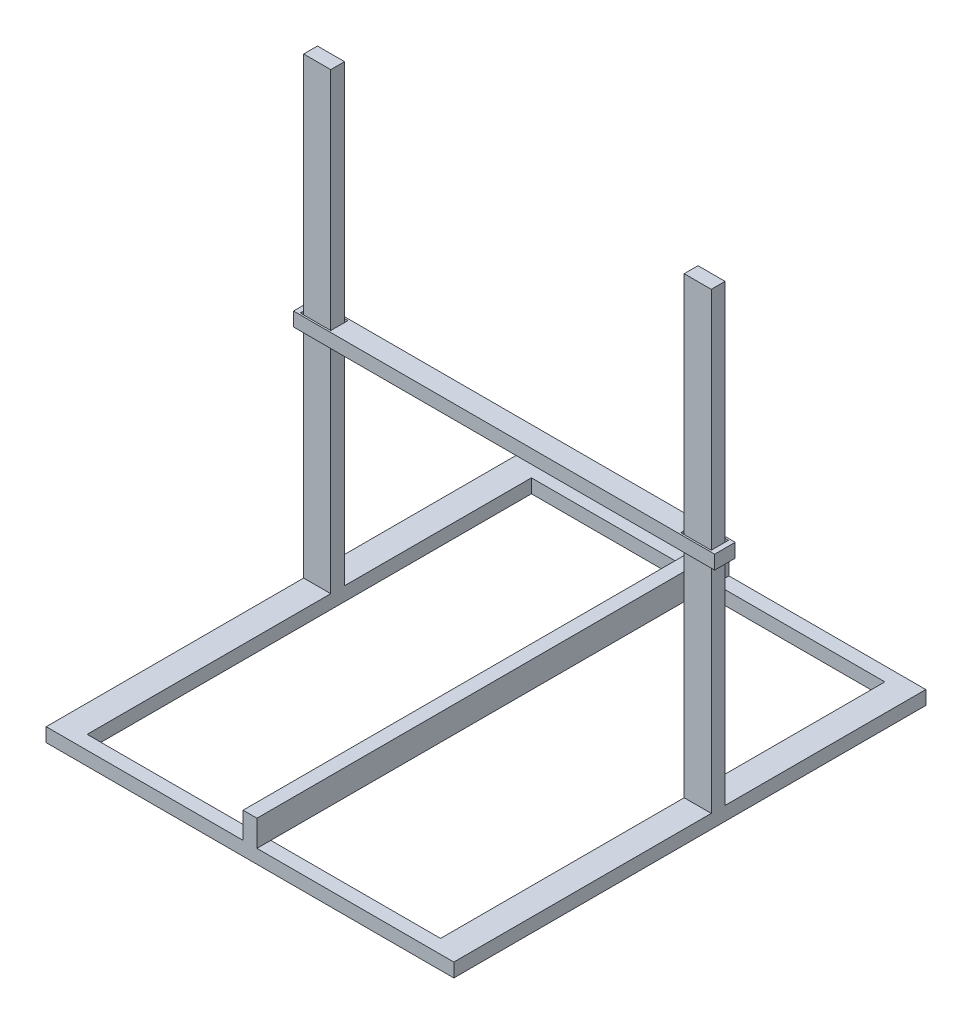
ISO-10303-21;
HEADER;
FILE_DESCRIPTION(('STEP AP214'),'2;1');
FILE_NAME('part.step','',(''),(''),'','','');
FILE_SCHEMA(('AUTOMOTIVE_DESIGN { 1 0 10303 214 1 1 1 1 }'));
ENDSEC;
DATA;
#1=APPLICATION_CONTEXT('core data for automotive mechanical design processes');
#2=APPLICATION_PROTOCOL_DEFINITION('international standard','automotive_design',2000,#1);
#3=PRODUCT_CONTEXT('',#1,'mechanical');
#4=PRODUCT('Part','Part','',(#3));
#5=PRODUCT_RELATED_PRODUCT_CATEGORY('part','',(#4));
#6=PRODUCT_DEFINITION_FORMATION('','',#4);
#7=PRODUCT_DEFINITION_CONTEXT('part definition',#1,'design');
#8=PRODUCT_DEFINITION('design','',#6,#7);
#9=PRODUCT_DEFINITION_SHAPE('','',#8);
#10=(LENGTH_UNIT() NAMED_UNIT(*) SI_UNIT(.MILLI.,.METRE.));
#11=(NAMED_UNIT(*) PLANE_ANGLE_UNIT() SI_UNIT($,.RADIAN.));
#12=(NAMED_UNIT(*) SI_UNIT($,.STERADIAN.) SOLID_ANGLE_UNIT());
#13=UNCERTAINTY_MEASURE_WITH_UNIT(LENGTH_MEASURE(1.E-05),#10,'distance_accuracy_value','');
#14=(GEOMETRIC_REPRESENTATION_CONTEXT(3) GLOBAL_UNCERTAINTY_ASSIGNED_CONTEXT((#13)) GLOBAL_UNIT_ASSIGNED_CONTEXT((#10,
#11,#12)) REPRESENTATION_CONTEXT('',''));
#15=CARTESIAN_POINT('',(0.,0.,0.));
#16=DIRECTION('',(0.,0.,1.));
#17=DIRECTION('',(1.,0.,0.));
#18=AXIS2_PLACEMENT_3D('',#15,#16,#17);
#19=CARTESIAN_POINT('',(0.,360.235,0.));
#20=DIRECTION('',(0.,1.,0.));
#21=DIRECTION('',(0.,0.,1.));
#22=AXIS2_PLACEMENT_3D('',#19,#20,#21);
#23=PLANE('',#22);
#24=DIRECTION('',(0.,0.,-1.));
#25=VECTOR('',#24,1.);
#26=CARTESIAN_POINT('',(311.625,360.235,-26.7500000000001));
#27=LINE('',#26,#25);
#28=CARTESIAN_POINT('',(311.625,360.235,-26.7500000000001));
#29=VERTEX_POINT('',#28);
#30=CARTESIAN_POINT('',(311.625,360.235,-57.2200000000001));
#31=VERTEX_POINT('',#30);
#32=EDGE_CURVE('E234',#29,#31,#27,.T.);
#33=ORIENTED_EDGE('',*,*,#32,.T.);
#34=DIRECTION('',(-1.,0.,0.));
#35=VECTOR('',#34,1.);
#36=CARTESIAN_POINT('',(311.625,360.235,-57.2200000000001));
#37=LINE('',#36,#35);
#38=CARTESIAN_POINT('',(-311.625,360.235,-57.22));
#39=VERTEX_POINT('',#38);
#40=EDGE_CURVE('E238',#31,#39,#37,.T.);
#41=ORIENTED_EDGE('',*,*,#40,.T.);
#42=DIRECTION('',(0.,0.,1.));
#43=VECTOR('',#42,1.);
#44=CARTESIAN_POINT('',(-311.625,360.235,-26.75));
#45=LINE('',#44,#43);
#46=CARTESIAN_POINT('',(-311.625,360.235,-26.75));
#47=VERTEX_POINT('',#46);
#48=EDGE_CURVE('E242',#39,#47,#45,.T.);
#49=ORIENTED_EDGE('',*,*,#48,.T.);
#50=DIRECTION('',(1.,0.,0.));
#51=VECTOR('',#50,1.);
#52=CARTESIAN_POINT('',(311.625,360.235,-26.7500000000001));
#53=LINE('',#52,#51);
#54=EDGE_CURVE('E245',#47,#29,#53,.T.);
#55=ORIENTED_EDGE('',*,*,#54,.T.);
#56=EDGE_LOOP('',(#33,#41,#49,#55));
#57=FACE_BOUND('',#56,.T.);
#58=DIRECTION('',(1.,0.,0.));
#59=VECTOR('',#58,1.);
#60=CARTESIAN_POINT('',(304.125,360.235,-29.2500000000002));
#61=LINE('',#60,#59);
#62=CARTESIAN_POINT('',(259.025,360.235,-29.2500000000002));
#63=VERTEX_POINT('',#62);
#64=CARTESIAN_POINT('',(304.125,360.235,-29.2500000000002));
#65=VERTEX_POINT('',#64);
#66=EDGE_CURVE('E194',#63,#65,#61,.T.);
#67=ORIENTED_EDGE('',*,*,#66,.F.);
#68=DIRECTION('',(0.,0.,1.));
#69=VECTOR('',#68,1.);
#70=CARTESIAN_POINT('',(259.025,360.235,-54.72));
#71=LINE('',#70,#69);
#72=CARTESIAN_POINT('',(259.025,360.235,-54.72));
#73=VERTEX_POINT('',#72);
#74=EDGE_CURVE('E191',#73,#63,#71,.T.);
#75=ORIENTED_EDGE('',*,*,#74,.F.);
#76=DIRECTION('',(-1.,0.,0.));
#77=VECTOR('',#76,1.);
#78=CARTESIAN_POINT('',(304.125,360.235,-54.72));
#79=LINE('',#78,#77);
#80=CARTESIAN_POINT('',(304.125,360.235,-54.72));
#81=VERTEX_POINT('',#80);
#82=EDGE_CURVE('E202',#81,#73,#79,.T.);
#83=ORIENTED_EDGE('',*,*,#82,.F.);
#84=DIRECTION('',(0.,0.,-1.));
#85=VECTOR('',#84,1.);
#86=CARTESIAN_POINT('',(304.125,360.235,-54.72));
#87=LINE('',#86,#85);
#88=EDGE_CURVE('E198',#65,#81,#87,.T.);
#89=ORIENTED_EDGE('',*,*,#88,.F.);
#90=EDGE_LOOP('',(#67,#75,#83,#89));
#91=FACE_BOUND('',#90,.T.);
#92=DIRECTION('',(1.,0.,0.));
#93=VECTOR('',#92,1.);
#94=CARTESIAN_POINT('',(-259.025,360.235,-29.2500000000001));
#95=LINE('',#94,#93);
#96=CARTESIAN_POINT('',(-304.125,360.235,-29.25));
#97=VERTEX_POINT('',#96);
#98=CARTESIAN_POINT('',(-259.025,360.235,-29.2500000000001));
#99=VERTEX_POINT('',#98);
#100=EDGE_CURVE('E152',#97,#99,#95,.T.);
#101=ORIENTED_EDGE('',*,*,#100,.F.);
#102=DIRECTION('',(0.,0.,1.));
#103=VECTOR('',#102,1.);
#104=CARTESIAN_POINT('',(-304.125,360.235,-29.25));
#105=LINE('',#104,#103);
#106=CARTESIAN_POINT('',(-304.125,360.235,-54.7199999999999));
#107=VERTEX_POINT('',#106);
#108=EDGE_CURVE('E143',#107,#97,#105,.T.);
#109=ORIENTED_EDGE('',*,*,#108,.F.);
#110=DIRECTION('',(-1.,0.,0.));
#111=VECTOR('',#110,1.);
#112=CARTESIAN_POINT('',(-259.025,360.235,-54.7199999999999));
#113=LINE('',#112,#111);
#114=CARTESIAN_POINT('',(-259.025,360.235,-54.7199999999999));
#115=VERTEX_POINT('',#114);
#116=EDGE_CURVE('E169',#115,#107,#113,.T.);
#117=ORIENTED_EDGE('',*,*,#116,.F.);
#118=DIRECTION('',(0.,0.,-1.));
#119=VECTOR('',#118,1.);
#120=CARTESIAN_POINT('',(-259.025,360.235,-29.2500000000001));
#121=LINE('',#120,#119);
#122=EDGE_CURVE('E165',#99,#115,#121,.T.);
#123=ORIENTED_EDGE('',*,*,#122,.F.);
#124=EDGE_LOOP('',(#101,#109,#117,#123));
#125=FACE_BOUND('',#124,.T.);
#126=ADVANCED_FACE('F53',(#57,#91,#125),#23,.T.);
#127=CARTESIAN_POINT('',(0.,339.765,0.));
#128=DIRECTION('',(0.,1.,0.));
#129=DIRECTION('',(0.,0.,1.));
#130=AXIS2_PLACEMENT_3D('',#127,#128,#129);
#131=PLANE('',#130);
#132=DIRECTION('',(0.,0.,1.));
#133=VECTOR('',#132,1.);
#134=CARTESIAN_POINT('',(259.025,339.765,-54.72));
#135=LINE('',#134,#133);
#136=CARTESIAN_POINT('',(259.025,339.765,-54.72));
#137=VERTEX_POINT('',#136);
#138=CARTESIAN_POINT('',(259.025,339.765,-29.2500000000002));
#139=VERTEX_POINT('',#138);
#140=EDGE_CURVE('E161',#137,#139,#135,.T.);
#141=ORIENTED_EDGE('',*,*,#140,.T.);
#142=DIRECTION('',(1.,0.,0.));
#143=VECTOR('',#142,1.);
#144=CARTESIAN_POINT('',(304.125,339.765,-29.2500000000002));
#145=LINE('',#144,#143);
#146=CARTESIAN_POINT('',(304.125,339.765,-29.2500000000002));
#147=VERTEX_POINT('',#146);
#148=EDGE_CURVE('E209',#139,#147,#145,.T.);
#149=ORIENTED_EDGE('',*,*,#148,.T.);
#150=DIRECTION('',(0.,0.,-1.));
#151=VECTOR('',#150,1.);
#152=CARTESIAN_POINT('',(304.125,339.765,-54.72));
#153=LINE('',#152,#151);
#154=CARTESIAN_POINT('',(304.125,339.765,-54.72));
#155=VERTEX_POINT('',#154);
#156=EDGE_CURVE('E213',#147,#155,#153,.T.);
#157=ORIENTED_EDGE('',*,*,#156,.T.);
#158=DIRECTION('',(-1.,0.,0.));
#159=VECTOR('',#158,1.);
#160=CARTESIAN_POINT('',(304.125,339.765,-54.72));
#161=LINE('',#160,#159);
#162=EDGE_CURVE('E195',#155,#137,#161,.T.);
#163=ORIENTED_EDGE('',*,*,#162,.T.);
#164=EDGE_LOOP('',(#141,#149,#157,#163));
#165=FACE_BOUND('',#164,.T.);
#166=DIRECTION('',(0.,0.,-1.));
#167=VECTOR('',#166,1.);
#168=CARTESIAN_POINT('',(311.625,339.765,-26.7500000000001));
#169=LINE('',#168,#167);
#170=CARTESIAN_POINT('',(311.625,339.765,-26.7500000000001));
#171=VERTEX_POINT('',#170);
#172=CARTESIAN_POINT('',(311.625,339.765,-57.2200000000001));
#173=VERTEX_POINT('',#172);
#174=EDGE_CURVE('E233',#171,#173,#169,.T.);
#175=ORIENTED_EDGE('',*,*,#174,.F.);
#176=DIRECTION('',(1.,0.,0.));
#177=VECTOR('',#176,1.);
#178=CARTESIAN_POINT('',(311.625,339.765,-26.7500000000001));
#179=LINE('',#178,#177);
#180=CARTESIAN_POINT('',(-311.625,339.765,-26.75));
#181=VERTEX_POINT('',#180);
#182=EDGE_CURVE('E239',#181,#171,#179,.T.);
#183=ORIENTED_EDGE('',*,*,#182,.F.);
#184=DIRECTION('',(0.,0.,1.));
#185=VECTOR('',#184,1.);
#186=CARTESIAN_POINT('',(-311.625,339.765,-26.75));
#187=LINE('',#186,#185);
#188=CARTESIAN_POINT('',(-311.625,339.765,-57.22));
#189=VERTEX_POINT('',#188);
#190=EDGE_CURVE('E255',#189,#181,#187,.T.);
#191=ORIENTED_EDGE('',*,*,#190,.F.);
#192=DIRECTION('',(-1.,0.,0.));
#193=VECTOR('',#192,1.);
#194=CARTESIAN_POINT('',(311.625,339.765,-57.2200000000001));
#195=LINE('',#194,#193);
#196=EDGE_CURVE('E252',#173,#189,#195,.T.);
#197=ORIENTED_EDGE('',*,*,#196,.F.);
#198=EDGE_LOOP('',(#175,#183,#191,#197));
#199=FACE_BOUND('',#198,.T.);
#200=DIRECTION('',(0.,0.,1.));
#201=VECTOR('',#200,1.);
#202=CARTESIAN_POINT('',(-304.125,339.765,-29.25));
#203=LINE('',#202,#201);
#204=CARTESIAN_POINT('',(-304.125,339.765,-54.7199999999999));
#205=VERTEX_POINT('',#204);
#206=CARTESIAN_POINT('',(-304.125,339.765,-29.25));
#207=VERTEX_POINT('',#206);
#208=EDGE_CURVE('E77',#205,#207,#203,.T.);
#209=ORIENTED_EDGE('',*,*,#208,.T.);
#210=DIRECTION('',(1.,0.,0.));
#211=VECTOR('',#210,1.);
#212=CARTESIAN_POINT('',(-259.025,339.765,-29.2500000000001));
#213=LINE('',#212,#211);
#214=CARTESIAN_POINT('',(-259.025,339.765,-29.2500000000001));
#215=VERTEX_POINT('',#214);
#216=EDGE_CURVE('E159',#207,#215,#213,.T.);
#217=ORIENTED_EDGE('',*,*,#216,.T.);
#218=DIRECTION('',(0.,0.,-1.));
#219=VECTOR('',#218,1.);
#220=CARTESIAN_POINT('',(-259.025,339.765,-29.2500000000001));
#221=LINE('',#220,#219);
#222=CARTESIAN_POINT('',(-259.025,339.765,-54.7199999999999));
#223=VERTEX_POINT('',#222);
#224=EDGE_CURVE('E178',#215,#223,#221,.T.);
#225=ORIENTED_EDGE('',*,*,#224,.T.);
#226=DIRECTION('',(-1.,0.,0.));
#227=VECTOR('',#226,1.);
#228=CARTESIAN_POINT('',(-259.025,339.765,-54.7199999999999));
#229=LINE('',#228,#227);
#230=EDGE_CURVE('E153',#223,#205,#229,.T.);
#231=ORIENTED_EDGE('',*,*,#230,.T.);
#232=EDGE_LOOP('',(#209,#217,#225,#231));
#233=FACE_BOUND('',#232,.T.);
#234=ADVANCED_FACE('F278',(#165,#199,#233),#131,.F.);
#235=CARTESIAN_POINT('',(311.625,360.235,-26.7500000000001));
#236=DIRECTION('',(-1.,0.,0.));
#237=DIRECTION('',(0.,0.,1.));
#238=AXIS2_PLACEMENT_3D('',#235,#236,#237);
#239=PLANE('',#238);
#240=ORIENTED_EDGE('',*,*,#174,.T.);
#241=DIRECTION('',(0.,-1.,0.));
#242=VECTOR('',#241,1.);
#243=CARTESIAN_POINT('',(311.625,360.235,-57.2200000000001));
#244=LINE('',#243,#242);
#245=EDGE_CURVE('E12',#31,#173,#244,.T.);
#246=ORIENTED_EDGE('',*,*,#245,.F.);
#247=ORIENTED_EDGE('',*,*,#32,.F.);
#248=DIRECTION('',(0.,-1.,0.));
#249=VECTOR('',#248,1.);
#250=CARTESIAN_POINT('',(311.625,360.235,-26.7500000000001));
#251=LINE('',#250,#249);
#252=EDGE_CURVE('E248',#29,#171,#251,.T.);
#253=ORIENTED_EDGE('',*,*,#252,.T.);
#254=EDGE_LOOP('',(#240,#246,#247,#253));
#255=FACE_BOUND('',#254,.T.);
#256=ADVANCED_FACE('F55',(#255),#239,.F.);
#257=CARTESIAN_POINT('',(311.625,360.235,-57.2200000000001));
#258=DIRECTION('',(0.,0.,1.));
#259=DIRECTION('',(1.,0.,0.));
#260=AXIS2_PLACEMENT_3D('',#257,#258,#259);
#261=PLANE('',#260);
#262=ORIENTED_EDGE('',*,*,#196,.T.);
#263=DIRECTION('',(0.,-1.,0.));
#264=VECTOR('',#263,1.);
#265=CARTESIAN_POINT('',(-311.625,360.235,-57.22));
#266=LINE('',#265,#264);
#267=EDGE_CURVE('E62',#39,#189,#266,.T.);
#268=ORIENTED_EDGE('',*,*,#267,.F.);
#269=ORIENTED_EDGE('',*,*,#40,.F.);
#270=ORIENTED_EDGE('',*,*,#245,.T.);
#271=EDGE_LOOP('',(#262,#268,#269,#270));
#272=FACE_BOUND('',#271,.T.);
#273=ADVANCED_FACE('F289',(#272),#261,.F.);
#274=CARTESIAN_POINT('',(-311.625,360.235,-26.75));
#275=DIRECTION('',(1.,0.,0.));
#276=DIRECTION('',(0.,0.,-1.));
#277=AXIS2_PLACEMENT_3D('',#274,#275,#276);
#278=PLANE('',#277);
#279=ORIENTED_EDGE('',*,*,#190,.T.);
#280=DIRECTION('',(0.,-1.,0.));
#281=VECTOR('',#280,1.);
#282=CARTESIAN_POINT('',(-311.625,360.235,-26.75));
#283=LINE('',#282,#281);
#284=EDGE_CURVE('E263',#47,#181,#283,.T.);
#285=ORIENTED_EDGE('',*,*,#284,.F.);
#286=ORIENTED_EDGE('',*,*,#48,.F.);
#287=ORIENTED_EDGE('',*,*,#267,.T.);
#288=EDGE_LOOP('',(#279,#285,#286,#287));
#289=FACE_BOUND('',#288,.T.);
#290=ADVANCED_FACE('F272',(#289),#278,.F.);
#291=CARTESIAN_POINT('',(311.625,360.235,-26.7500000000001));
#292=DIRECTION('',(0.,0.,-1.));
#293=DIRECTION('',(-1.,0.,0.));
#294=AXIS2_PLACEMENT_3D('',#291,#292,#293);
#295=PLANE('',#294);
#296=ORIENTED_EDGE('',*,*,#182,.T.);
#297=ORIENTED_EDGE('',*,*,#252,.F.);
#298=ORIENTED_EDGE('',*,*,#54,.F.);
#299=ORIENTED_EDGE('',*,*,#284,.T.);
#300=EDGE_LOOP('',(#296,#297,#298,#299));
#301=FACE_BOUND('',#300,.T.);
#302=ADVANCED_FACE('F282',(#301),#295,.F.);
#303=CARTESIAN_POINT('',(259.025,360.235,-54.72));
#304=DIRECTION('',(1.,0.,0.));
#305=DIRECTION('',(0.,0.,-1.));
#306=AXIS2_PLACEMENT_3D('',#303,#304,#305);
#307=PLANE('',#306);
#308=ORIENTED_EDGE('',*,*,#140,.F.);
#309=DIRECTION('',(0.,-1.,0.));
#310=VECTOR('',#309,1.);
#311=CARTESIAN_POINT('',(259.025,360.235,-54.72));
#312=LINE('',#311,#310);
#313=EDGE_CURVE('E205',#73,#137,#312,.T.);
#314=ORIENTED_EDGE('',*,*,#313,.F.);
#315=ORIENTED_EDGE('',*,*,#74,.T.);
#316=DIRECTION('',(0.,-1.,0.));
#317=VECTOR('',#316,1.);
#318=CARTESIAN_POINT('',(259.025,360.235,-29.2500000000002));
#319=LINE('',#318,#317);
#320=EDGE_CURVE('E229',#63,#139,#319,.T.);
#321=ORIENTED_EDGE('',*,*,#320,.T.);
#322=EDGE_LOOP('',(#308,#314,#315,#321));
#323=FACE_BOUND('',#322,.T.);
#324=ADVANCED_FACE('F304',(#323),#307,.T.);
#325=CARTESIAN_POINT('',(304.125,360.235,-29.2500000000002));
#326=DIRECTION('',(0.,0.,-1.));
#327=DIRECTION('',(-1.,0.,0.));
#328=AXIS2_PLACEMENT_3D('',#325,#326,#327);
#329=PLANE('',#328);
#330=ORIENTED_EDGE('',*,*,#148,.F.);
#331=ORIENTED_EDGE('',*,*,#320,.F.);
#332=ORIENTED_EDGE('',*,*,#66,.T.);
#333=DIRECTION('',(0.,-1.,0.));
#334=VECTOR('',#333,1.);
#335=CARTESIAN_POINT('',(304.125,360.235,-29.2500000000002));
#336=LINE('',#335,#334);
#337=EDGE_CURVE('E226',#65,#147,#336,.T.);
#338=ORIENTED_EDGE('',*,*,#337,.T.);
#339=EDGE_LOOP('',(#330,#331,#332,#338));
#340=FACE_BOUND('',#339,.T.);
#341=ADVANCED_FACE('F311',(#340),#329,.T.);
#342=CARTESIAN_POINT('',(304.125,360.235,-54.72));
#343=DIRECTION('',(-1.,0.,0.));
#344=DIRECTION('',(0.,0.,1.));
#345=AXIS2_PLACEMENT_3D('',#342,#343,#344);
#346=PLANE('',#345);
#347=ORIENTED_EDGE('',*,*,#156,.F.);
#348=ORIENTED_EDGE('',*,*,#337,.F.);
#349=ORIENTED_EDGE('',*,*,#88,.T.);
#350=DIRECTION('',(0.,-1.,0.));
#351=VECTOR('',#350,1.);
#352=CARTESIAN_POINT('',(304.125,360.235,-54.72));
#353=LINE('',#352,#351);
#354=EDGE_CURVE('E223',#81,#155,#353,.T.);
#355=ORIENTED_EDGE('',*,*,#354,.T.);
#356=EDGE_LOOP('',(#347,#348,#349,#355));
#357=FACE_BOUND('',#356,.T.);
#358=ADVANCED_FACE('F316',(#357),#346,.T.);
#359=CARTESIAN_POINT('',(304.125,360.235,-54.72));
#360=DIRECTION('',(0.,0.,1.));
#361=DIRECTION('',(1.,0.,0.));
#362=AXIS2_PLACEMENT_3D('',#359,#360,#361);
#363=PLANE('',#362);
#364=ORIENTED_EDGE('',*,*,#162,.F.);
#365=ORIENTED_EDGE('',*,*,#354,.F.);
#366=ORIENTED_EDGE('',*,*,#82,.T.);
#367=ORIENTED_EDGE('',*,*,#313,.T.);
#368=EDGE_LOOP('',(#364,#365,#366,#367));
#369=FACE_BOUND('',#368,.T.);
#370=ADVANCED_FACE('F323',(#369),#363,.T.);
#371=CARTESIAN_POINT('',(-304.125,360.235,-29.25));
#372=DIRECTION('',(1.,0.,0.));
#373=DIRECTION('',(0.,0.,-1.));
#374=AXIS2_PLACEMENT_3D('',#371,#372,#373);
#375=PLANE('',#374);
#376=ORIENTED_EDGE('',*,*,#208,.F.);
#377=DIRECTION('',(0.,-1.,0.));
#378=VECTOR('',#377,1.);
#379=CARTESIAN_POINT('',(-304.125,360.235,-54.7199999999999));
#380=LINE('',#379,#378);
#381=EDGE_CURVE('E147',#107,#205,#380,.T.);
#382=ORIENTED_EDGE('',*,*,#381,.F.);
#383=ORIENTED_EDGE('',*,*,#108,.T.);
#384=DIRECTION('',(0.,-1.,0.));
#385=VECTOR('',#384,1.);
#386=CARTESIAN_POINT('',(-304.125,360.235,-29.25));
#387=LINE('',#386,#385);
#388=EDGE_CURVE('E146',#97,#207,#387,.T.);
#389=ORIENTED_EDGE('',*,*,#388,.T.);
#390=EDGE_LOOP('',(#376,#382,#383,#389));
#391=FACE_BOUND('',#390,.T.);
#392=ADVANCED_FACE('F145',(#391),#375,.T.);
#393=CARTESIAN_POINT('',(-259.025,360.235,-29.2500000000001));
#394=DIRECTION('',(0.,0.,-1.));
#395=DIRECTION('',(-1.,0.,0.));
#396=AXIS2_PLACEMENT_3D('',#393,#394,#395);
#397=PLANE('',#396);
#398=ORIENTED_EDGE('',*,*,#216,.F.);
#399=ORIENTED_EDGE('',*,*,#388,.F.);
#400=ORIENTED_EDGE('',*,*,#100,.T.);
#401=DIRECTION('',(0.,-1.,0.));
#402=VECTOR('',#401,1.);
#403=CARTESIAN_POINT('',(-259.025,360.235,-29.2500000000001));
#404=LINE('',#403,#402);
#405=EDGE_CURVE('E162',#99,#215,#404,.T.);
#406=ORIENTED_EDGE('',*,*,#405,.T.);
#407=EDGE_LOOP('',(#398,#399,#400,#406));
#408=FACE_BOUND('',#407,.T.);
#409=ADVANCED_FACE('F156',(#408),#397,.T.);
#410=CARTESIAN_POINT('',(-259.025,360.235,-29.2500000000001));
#411=DIRECTION('',(-1.,0.,0.));
#412=DIRECTION('',(0.,0.,1.));
#413=AXIS2_PLACEMENT_3D('',#410,#411,#412);
#414=PLANE('',#413);
#415=ORIENTED_EDGE('',*,*,#224,.F.);
#416=ORIENTED_EDGE('',*,*,#405,.F.);
#417=ORIENTED_EDGE('',*,*,#122,.T.);
#418=DIRECTION('',(0.,-1.,0.));
#419=VECTOR('',#418,1.);
#420=CARTESIAN_POINT('',(-259.025,360.235,-54.7199999999999));
#421=LINE('',#420,#419);
#422=EDGE_CURVE('E69',#115,#223,#421,.T.);
#423=ORIENTED_EDGE('',*,*,#422,.T.);
#424=EDGE_LOOP('',(#415,#416,#417,#423));
#425=FACE_BOUND('',#424,.T.);
#426=ADVANCED_FACE('F341',(#425),#414,.T.);
#427=CARTESIAN_POINT('',(-259.025,360.235,-54.7199999999999));
#428=DIRECTION('',(0.,0.,1.));
#429=DIRECTION('',(1.,0.,0.));
#430=AXIS2_PLACEMENT_3D('',#427,#428,#429);
#431=PLANE('',#430);
#432=ORIENTED_EDGE('',*,*,#230,.F.);
#433=ORIENTED_EDGE('',*,*,#422,.F.);
#434=ORIENTED_EDGE('',*,*,#116,.T.);
#435=ORIENTED_EDGE('',*,*,#381,.T.);
#436=EDGE_LOOP('',(#432,#433,#434,#435));
#437=FACE_BOUND('',#436,.T.);
#438=ADVANCED_FACE('F344',(#437),#431,.T.);
#439=CLOSED_SHELL('',(#126,#234,#256,#273,#290,#302,#324,#341,#358,#370,#392,#409,#426,#438));
#440=MANIFOLD_SOLID_BREP('B2',#439);
#441=CARTESIAN_POINT('',(0.,20.47,0.));
#442=DIRECTION('',(0.,-1.,0.));
#443=DIRECTION('',(0.,0.,-1.));
#444=AXIS2_PLACEMENT_3D('',#441,#442,#443);
#445=PLANE('',#444);
#446=DIRECTION('',(0.,0.,-1.));
#447=VECTOR('',#446,1.);
#448=CARTESIAN_POINT('',(10.27,20.47,-349.25));
#449=LINE('',#448,#447);
#450=CARTESIAN_POINT('',(10.27,20.47,349.25));
#451=VERTEX_POINT('',#450);
#452=CARTESIAN_POINT('',(10.27,20.47,328.78));
#453=VERTEX_POINT('',#452);
#454=EDGE_CURVE('E440',#451,#453,#449,.T.);
#455=ORIENTED_EDGE('',*,*,#454,.F.);
#456=DIRECTION('',(1.,0.,0.));
#457=VECTOR('',#456,1.);
#458=CARTESIAN_POINT('',(-301.625,20.47,349.25));
#459=LINE('',#458,#457);
#460=CARTESIAN_POINT('',(301.625,20.47,349.25));
#461=VERTEX_POINT('',#460);
#462=EDGE_CURVE('E707',#451,#461,#459,.T.);
#463=ORIENTED_EDGE('',*,*,#462,.T.);
#464=DIRECTION('',(0.,0.,-1.));
#465=VECTOR('',#464,1.);
#466=CARTESIAN_POINT('',(301.625,20.47,349.25));
#467=LINE('',#466,#465);
#468=CARTESIAN_POINT('',(301.625,20.47,-31.7500000000001));
#469=VERTEX_POINT('',#468);
#470=EDGE_CURVE('E697',#461,#469,#467,.T.);
#471=ORIENTED_EDGE('',*,*,#470,.T.);
#472=DIRECTION('',(1.,0.,0.));
#473=VECTOR('',#472,1.);
#474=CARTESIAN_POINT('',(301.625,20.47,-31.7500000000001));
#475=LINE('',#474,#473);
#476=CARTESIAN_POINT('',(261.525,20.47,-31.7500000000001));
#477=VERTEX_POINT('',#476);
#478=EDGE_CURVE('E602',#477,#469,#475,.T.);
#479=ORIENTED_EDGE('',*,*,#478,.F.);
#480=DIRECTION('',(0.,0.,-1.));
#481=VECTOR('',#480,1.);
#482=CARTESIAN_POINT('',(261.525,20.47,-328.78));
#483=LINE('',#482,#481);
#484=CARTESIAN_POINT('',(261.525,20.47,328.78));
#485=VERTEX_POINT('',#484);
#486=EDGE_CURVE('E667',#485,#477,#483,.T.);
#487=ORIENTED_EDGE('',*,*,#486,.F.);
#488=DIRECTION('',(1.,0.,0.));
#489=VECTOR('',#488,1.);
#490=CARTESIAN_POINT('',(261.525,20.47,328.78));
#491=LINE('',#490,#489);
#492=EDGE_CURVE('E661',#453,#485,#491,.T.);
#493=ORIENTED_EDGE('',*,*,#492,.F.);
#494=EDGE_LOOP('',(#455,#463,#471,#479,#487,#493));
#495=FACE_BOUND('',#494,.T.);
#496=ADVANCED_FACE('F425',(#495),#445,.F.);
#497=DIRECTION('',(0.,0.,1.));
#498=VECTOR('',#497,1.);
#499=CARTESIAN_POINT('',(-10.27,20.47,-349.25));
#500=LINE('',#499,#498);
#501=CARTESIAN_POINT('',(-10.27,20.47,328.78));
#502=VERTEX_POINT('',#501);
#503=CARTESIAN_POINT('',(-10.27,20.47,349.25));
#504=VERTEX_POINT('',#503);
#505=EDGE_CURVE('E757',#502,#504,#500,.T.);
#506=ORIENTED_EDGE('',*,*,#505,.F.);
#507=CARTESIAN_POINT('',(-261.525,20.47,328.78));
#508=VERTEX_POINT('',#507);
#509=EDGE_CURVE('E663',#508,#502,#491,.T.);
#510=ORIENTED_EDGE('',*,*,#509,.F.);
#511=DIRECTION('',(0.,0.,1.));
#512=VECTOR('',#511,1.);
#513=CARTESIAN_POINT('',(-261.525,20.47,-328.78));
#514=LINE('',#513,#512);
#515=CARTESIAN_POINT('',(-261.525,20.47,-31.75));
#516=VERTEX_POINT('',#515);
#517=EDGE_CURVE('E662',#516,#508,#514,.T.);
#518=ORIENTED_EDGE('',*,*,#517,.F.);
#519=DIRECTION('',(1.,0.,0.));
#520=VECTOR('',#519,1.);
#521=CARTESIAN_POINT('',(-261.525,20.47,-31.75));
#522=LINE('',#521,#520);
#523=CARTESIAN_POINT('',(-301.625,20.47,-31.75));
#524=VERTEX_POINT('',#523);
#525=EDGE_CURVE('E630',#524,#516,#522,.T.);
#526=ORIENTED_EDGE('',*,*,#525,.F.);
#527=DIRECTION('',(0.,0.,1.));
#528=VECTOR('',#527,1.);
#529=CARTESIAN_POINT('',(-301.625,20.47,349.25));
#530=LINE('',#529,#528);
#531=CARTESIAN_POINT('',(-301.625,20.47,349.25));
#532=VERTEX_POINT('',#531);
#533=EDGE_CURVE('E704',#524,#532,#530,.T.);
#534=ORIENTED_EDGE('',*,*,#533,.T.);
#535=EDGE_CURVE('E708',#532,#504,#459,.T.);
#536=ORIENTED_EDGE('',*,*,#535,.T.);
#537=EDGE_LOOP('',(#506,#510,#518,#526,#534,#536));
#538=FACE_BOUND('',#537,.T.);
#539=ADVANCED_FACE('F764',(#538),#445,.F.);
#540=CARTESIAN_POINT('',(10.27,20.47,-328.78));
#541=VERTEX_POINT('',#540);
#542=CARTESIAN_POINT('',(10.27,20.47,-349.25));
#543=VERTEX_POINT('',#542);
#544=EDGE_CURVE('E598',#541,#543,#449,.T.);
#545=ORIENTED_EDGE('',*,*,#544,.F.);
#546=DIRECTION('',(-1.,0.,0.));
#547=VECTOR('',#546,1.);
#548=CARTESIAN_POINT('',(261.525,20.47,-328.78));
#549=LINE('',#548,#547);
#550=CARTESIAN_POINT('',(261.525,20.47,-328.78));
#551=VERTEX_POINT('',#550);
#552=EDGE_CURVE('E671',#551,#541,#549,.T.);
#553=ORIENTED_EDGE('',*,*,#552,.F.);
#554=CARTESIAN_POINT('',(261.525,20.47,-52.2200000000001));
#555=VERTEX_POINT('',#554);
#556=EDGE_CURVE('E666',#555,#551,#483,.T.);
#557=ORIENTED_EDGE('',*,*,#556,.F.);
#558=DIRECTION('',(-1.,0.,0.));
#559=VECTOR('',#558,1.);
#560=CARTESIAN_POINT('',(301.625,20.47,-52.22));
#561=LINE('',#560,#559);
#562=CARTESIAN_POINT('',(301.625,20.47,-52.22));
#563=VERTEX_POINT('',#562);
#564=EDGE_CURVE('E612',#563,#555,#561,.T.);
#565=ORIENTED_EDGE('',*,*,#564,.F.);
#566=CARTESIAN_POINT('',(301.625,20.47,-349.25));
#567=VERTEX_POINT('',#566);
#568=EDGE_CURVE('E701',#563,#567,#467,.T.);
#569=ORIENTED_EDGE('',*,*,#568,.T.);
#570=DIRECTION('',(-1.,0.,0.));
#571=VECTOR('',#570,1.);
#572=CARTESIAN_POINT('',(-301.625,20.47,-349.25));
#573=LINE('',#572,#571);
#574=EDGE_CURVE('E702',#567,#543,#573,.T.);
#575=ORIENTED_EDGE('',*,*,#574,.T.);
#576=EDGE_LOOP('',(#545,#553,#557,#565,#569,#575));
#577=FACE_BOUND('',#576,.T.);
#578=ADVANCED_FACE('F799',(#577),#445,.F.);
#579=CARTESIAN_POINT('',(-10.27,20.47,-349.25));
#580=VERTEX_POINT('',#579);
#581=CARTESIAN_POINT('',(-10.27,20.47,-328.78));
#582=VERTEX_POINT('',#581);
#583=EDGE_CURVE('E448',#580,#582,#500,.T.);
#584=ORIENTED_EDGE('',*,*,#583,.F.);
#585=CARTESIAN_POINT('',(-301.625,20.47,-349.25));
#586=VERTEX_POINT('',#585);
#587=EDGE_CURVE('E700',#580,#586,#573,.T.);
#588=ORIENTED_EDGE('',*,*,#587,.T.);
#589=CARTESIAN_POINT('',(-301.625,20.47,-52.22));
#590=VERTEX_POINT('',#589);
#591=EDGE_CURVE('E705',#586,#590,#530,.T.);
#592=ORIENTED_EDGE('',*,*,#591,.T.);
#593=DIRECTION('',(-1.,0.,0.));
#594=VECTOR('',#593,1.);
#595=CARTESIAN_POINT('',(-261.525,20.47,-52.22));
#596=LINE('',#595,#594);
#597=CARTESIAN_POINT('',(-261.525,20.47,-52.22));
#598=VERTEX_POINT('',#597);
#599=EDGE_CURVE('E635',#598,#590,#596,.T.);
#600=ORIENTED_EDGE('',*,*,#599,.F.);
#601=CARTESIAN_POINT('',(-261.525,20.47,-328.78));
#602=VERTEX_POINT('',#601);
#603=EDGE_CURVE('E658',#602,#598,#514,.T.);
#604=ORIENTED_EDGE('',*,*,#603,.F.);
#605=EDGE_CURVE('E670',#582,#602,#549,.T.);
#606=ORIENTED_EDGE('',*,*,#605,.F.);
#607=EDGE_LOOP('',(#584,#588,#592,#600,#604,#606));
#608=FACE_BOUND('',#607,.T.);
#609=ADVANCED_FACE('F782',(#608),#445,.F.);
#610=CARTESIAN_POINT('',(0.,0.,0.));
#611=DIRECTION('',(0.,-1.,0.));
#612=DIRECTION('',(0.,0.,-1.));
#613=AXIS2_PLACEMENT_3D('',#610,#611,#612);
#614=PLANE('',#613);
#615=DIRECTION('',(0.,0.,-1.));
#616=VECTOR('',#615,1.);
#617=CARTESIAN_POINT('',(301.625,0.,349.25));
#618=LINE('',#617,#616);
#619=CARTESIAN_POINT('',(301.625,0.,349.25));
#620=VERTEX_POINT('',#619);
#621=CARTESIAN_POINT('',(301.625,0.,-349.25));
#622=VERTEX_POINT('',#621);
#623=EDGE_CURVE('E696',#620,#622,#618,.T.);
#624=ORIENTED_EDGE('',*,*,#623,.F.);
#625=DIRECTION('',(1.,0.,0.));
#626=VECTOR('',#625,1.);
#627=CARTESIAN_POINT('',(-301.625,0.,349.25));
#628=LINE('',#627,#626);
#629=CARTESIAN_POINT('',(-301.625,0.,349.25));
#630=VERTEX_POINT('',#629);
#631=EDGE_CURVE('E718',#630,#620,#628,.T.);
#632=ORIENTED_EDGE('',*,*,#631,.F.);
#633=DIRECTION('',(0.,0.,1.));
#634=VECTOR('',#633,1.);
#635=CARTESIAN_POINT('',(-301.625,0.,349.25));
#636=LINE('',#635,#634);
#637=CARTESIAN_POINT('',(-301.625,0.,-349.25));
#638=VERTEX_POINT('',#637);
#639=EDGE_CURVE('E716',#638,#630,#636,.T.);
#640=ORIENTED_EDGE('',*,*,#639,.F.);
#641=DIRECTION('',(-1.,0.,0.));
#642=VECTOR('',#641,1.);
#643=CARTESIAN_POINT('',(-301.625,0.,-349.25));
#644=LINE('',#643,#642);
#645=EDGE_CURVE('E714',#622,#638,#644,.T.);
#646=ORIENTED_EDGE('',*,*,#645,.F.);
#647=EDGE_LOOP('',(#624,#632,#640,#646));
#648=FACE_BOUND('',#647,.T.);
#649=DIRECTION('',(-1.,0.,0.));
#650=VECTOR('',#649,1.);
#651=CARTESIAN_POINT('',(261.525,0.,-328.78));
#652=LINE('',#651,#650);
#653=CARTESIAN_POINT('',(261.525,0.,-328.78));
#654=VERTEX_POINT('',#653);
#655=CARTESIAN_POINT('',(-261.525,0.,-328.78));
#656=VERTEX_POINT('',#655);
#657=EDGE_CURVE('E684',#654,#656,#652,.T.);
#658=ORIENTED_EDGE('',*,*,#657,.T.);
#659=DIRECTION('',(0.,0.,1.));
#660=VECTOR('',#659,1.);
#661=CARTESIAN_POINT('',(-261.525,0.,-328.78));
#662=LINE('',#661,#660);
#663=CARTESIAN_POINT('',(-261.525,0.,328.78));
#664=VERTEX_POINT('',#663);
#665=EDGE_CURVE('E657',#656,#664,#662,.T.);
#666=ORIENTED_EDGE('',*,*,#665,.T.);
#667=DIRECTION('',(1.,0.,0.));
#668=VECTOR('',#667,1.);
#669=CARTESIAN_POINT('',(261.525,0.,328.78));
#670=LINE('',#669,#668);
#671=CARTESIAN_POINT('',(261.525,0.,328.78));
#672=VERTEX_POINT('',#671);
#673=EDGE_CURVE('E678',#664,#672,#670,.T.);
#674=ORIENTED_EDGE('',*,*,#673,.T.);
#675=DIRECTION('',(0.,0.,-1.));
#676=VECTOR('',#675,1.);
#677=CARTESIAN_POINT('',(261.525,0.,-328.78));
#678=LINE('',#677,#676);
#679=EDGE_CURVE('E681',#672,#654,#678,.T.);
#680=ORIENTED_EDGE('',*,*,#679,.T.);
#681=EDGE_LOOP('',(#658,#666,#674,#680));
#682=FACE_BOUND('',#681,.T.);
#683=ADVANCED_FACE('F734',(#648,#682),#614,.T.);
#684=CARTESIAN_POINT('',(301.625,20.47,349.25));
#685=DIRECTION('',(-1.,0.,0.));
#686=DIRECTION('',(0.,0.,1.));
#687=AXIS2_PLACEMENT_3D('',#684,#685,#686);
#688=PLANE('',#687);
#689=ORIENTED_EDGE('',*,*,#623,.T.);
#690=DIRECTION('',(0.,-1.,0.));
#691=VECTOR('',#690,1.);
#692=CARTESIAN_POINT('',(301.625,20.47,-349.25));
#693=LINE('',#692,#691);
#694=EDGE_CURVE('E51',#567,#622,#693,.T.);
#695=ORIENTED_EDGE('',*,*,#694,.F.);
#696=ORIENTED_EDGE('',*,*,#568,.F.);
#697=DIRECTION('',(0.,-1.,0.));
#698=VECTOR('',#697,1.);
#699=CARTESIAN_POINT('',(301.625,692.15,-52.22));
#700=LINE('',#699,#698);
#701=CARTESIAN_POINT('',(301.625,692.15,-52.22));
#702=VERTEX_POINT('',#701);
#703=EDGE_CURVE('E623',#702,#563,#700,.T.);
#704=ORIENTED_EDGE('',*,*,#703,.F.);
#705=DIRECTION('',(0.,0.,-1.));
#706=VECTOR('',#705,1.);
#707=CARTESIAN_POINT('',(301.625,692.15,-52.22));
#708=LINE('',#707,#706);
#709=CARTESIAN_POINT('',(301.625,692.15,-31.7500000000001));
#710=VERTEX_POINT('',#709);
#711=EDGE_CURVE('E614',#710,#702,#708,.T.);
#712=ORIENTED_EDGE('',*,*,#711,.F.);
#713=DIRECTION('',(0.,-1.,0.));
#714=VECTOR('',#713,1.);
#715=CARTESIAN_POINT('',(301.625,692.15,-31.7500000000001));
#716=LINE('',#715,#714);
#717=EDGE_CURVE('E625',#710,#469,#716,.T.);
#718=ORIENTED_EDGE('',*,*,#717,.T.);
#719=ORIENTED_EDGE('',*,*,#470,.F.);
#720=DIRECTION('',(0.,-1.,0.));
#721=VECTOR('',#720,1.);
#722=CARTESIAN_POINT('',(301.625,20.47,349.25));
#723=LINE('',#722,#721);
#724=EDGE_CURVE('E711',#461,#620,#723,.T.);
#725=ORIENTED_EDGE('',*,*,#724,.T.);
#726=EDGE_LOOP('',(#689,#695,#696,#704,#712,#718,#719,#725));
#727=FACE_BOUND('',#726,.T.);
#728=ADVANCED_FACE('F427',(#727),#688,.F.);
#729=CARTESIAN_POINT('',(-301.625,20.47,-349.25));
#730=DIRECTION('',(0.,0.,1.));
#731=DIRECTION('',(1.,0.,0.));
#732=AXIS2_PLACEMENT_3D('',#729,#730,#731);
#733=PLANE('',#732);
#734=ORIENTED_EDGE('',*,*,#645,.T.);
#735=DIRECTION('',(0.,-1.,0.));
#736=VECTOR('',#735,1.);
#737=CARTESIAN_POINT('',(-301.625,20.47,-349.25));
#738=LINE('',#737,#736);
#739=EDGE_CURVE('E433',#586,#638,#738,.T.);
#740=ORIENTED_EDGE('',*,*,#739,.F.);
#741=ORIENTED_EDGE('',*,*,#587,.F.);
#742=DIRECTION('',(0.,-1.,0.));
#743=VECTOR('',#742,1.);
#744=CARTESIAN_POINT('',(-10.27,59.14,-349.25));
#745=LINE('',#744,#743);
#746=CARTESIAN_POINT('',(-10.27,59.14,-349.25));
#747=VERTEX_POINT('',#746);
#748=EDGE_CURVE('E584',#747,#580,#745,.T.);
#749=ORIENTED_EDGE('',*,*,#748,.F.);
#750=DIRECTION('',(-1.,0.,0.));
#751=VECTOR('',#750,1.);
#752=CARTESIAN_POINT('',(-10.27,59.14,-349.25));
#753=LINE('',#752,#751);
#754=CARTESIAN_POINT('',(10.27,59.14,-349.25));
#755=VERTEX_POINT('',#754);
#756=EDGE_CURVE('E576',#755,#747,#753,.T.);
#757=ORIENTED_EDGE('',*,*,#756,.F.);
#758=DIRECTION('',(0.,-1.,0.));
#759=VECTOR('',#758,1.);
#760=CARTESIAN_POINT('',(10.27,59.14,-349.25));
#761=LINE('',#760,#759);
#762=EDGE_CURVE('E581',#755,#543,#761,.T.);
#763=ORIENTED_EDGE('',*,*,#762,.T.);
#764=ORIENTED_EDGE('',*,*,#574,.F.);
#765=ORIENTED_EDGE('',*,*,#694,.T.);
#766=EDGE_LOOP('',(#734,#740,#741,#749,#757,#763,#764,#765));
#767=FACE_BOUND('',#766,.T.);
#768=ADVANCED_FACE('F578',(#767),#733,.F.);
#769=CARTESIAN_POINT('',(-301.625,20.47,349.25));
#770=DIRECTION('',(1.,0.,0.));
#771=DIRECTION('',(0.,0.,-1.));
#772=AXIS2_PLACEMENT_3D('',#769,#770,#771);
#773=PLANE('',#772);
#774=ORIENTED_EDGE('',*,*,#639,.T.);
#775=DIRECTION('',(0.,-1.,0.));
#776=VECTOR('',#775,1.);
#777=CARTESIAN_POINT('',(-301.625,20.47,349.25));
#778=LINE('',#777,#776);
#779=EDGE_CURVE('E722',#532,#630,#778,.T.);
#780=ORIENTED_EDGE('',*,*,#779,.F.);
#781=ORIENTED_EDGE('',*,*,#533,.F.);
#782=DIRECTION('',(0.,-1.,0.));
#783=VECTOR('',#782,1.);
#784=CARTESIAN_POINT('',(-301.625,692.15,-31.75));
#785=LINE('',#784,#783);
#786=CARTESIAN_POINT('',(-301.625,692.15,-31.75));
#787=VERTEX_POINT('',#786);
#788=EDGE_CURVE('E654',#787,#524,#785,.T.);
#789=ORIENTED_EDGE('',*,*,#788,.F.);
#790=DIRECTION('',(0.,0.,1.));
#791=VECTOR('',#790,1.);
#792=CARTESIAN_POINT('',(-301.625,692.15,-52.22));
#793=LINE('',#792,#791);
#794=CARTESIAN_POINT('',(-301.625,692.15,-52.22));
#795=VERTEX_POINT('',#794);
#796=EDGE_CURVE('E631',#795,#787,#793,.T.);
#797=ORIENTED_EDGE('',*,*,#796,.F.);
#798=DIRECTION('',(0.,-1.,0.));
#799=VECTOR('',#798,1.);
#800=CARTESIAN_POINT('',(-301.625,692.15,-52.22));
#801=LINE('',#800,#799);
#802=EDGE_CURVE('E641',#795,#590,#801,.T.);
#803=ORIENTED_EDGE('',*,*,#802,.T.);
#804=ORIENTED_EDGE('',*,*,#591,.F.);
#805=ORIENTED_EDGE('',*,*,#739,.T.);
#806=EDGE_LOOP('',(#774,#780,#781,#789,#797,#803,#804,#805));
#807=FACE_BOUND('',#806,.T.);
#808=ADVANCED_FACE('F729',(#807),#773,.F.);
#809=CARTESIAN_POINT('',(-301.625,20.47,349.25));
#810=DIRECTION('',(0.,0.,-1.));
#811=DIRECTION('',(-1.,0.,0.));
#812=AXIS2_PLACEMENT_3D('',#809,#810,#811);
#813=PLANE('',#812);
#814=ORIENTED_EDGE('',*,*,#631,.T.);
#815=ORIENTED_EDGE('',*,*,#724,.F.);
#816=ORIENTED_EDGE('',*,*,#462,.F.);
#817=DIRECTION('',(0.,-1.,0.));
#818=VECTOR('',#817,1.);
#819=CARTESIAN_POINT('',(10.27,59.14,349.25));
#820=LINE('',#819,#818);
#821=CARTESIAN_POINT('',(10.27,59.14,349.25));
#822=VERTEX_POINT('',#821);
#823=EDGE_CURVE('E750',#822,#451,#820,.T.);
#824=ORIENTED_EDGE('',*,*,#823,.F.);
#825=DIRECTION('',(1.,0.,0.));
#826=VECTOR('',#825,1.);
#827=CARTESIAN_POINT('',(-10.27,59.14,349.25));
#828=LINE('',#827,#826);
#829=CARTESIAN_POINT('',(-10.27,59.14,349.25));
#830=VERTEX_POINT('',#829);
#831=EDGE_CURVE('E593',#830,#822,#828,.T.);
#832=ORIENTED_EDGE('',*,*,#831,.F.);
#833=DIRECTION('',(0.,-1.,0.));
#834=VECTOR('',#833,1.);
#835=CARTESIAN_POINT('',(-10.27,59.14,349.25));
#836=LINE('',#835,#834);
#837=EDGE_CURVE('E604',#830,#504,#836,.T.);
#838=ORIENTED_EDGE('',*,*,#837,.T.);
#839=ORIENTED_EDGE('',*,*,#535,.F.);
#840=ORIENTED_EDGE('',*,*,#779,.T.);
#841=EDGE_LOOP('',(#814,#815,#816,#824,#832,#838,#839,#840));
#842=FACE_BOUND('',#841,.T.);
#843=ADVANCED_FACE('F738',(#842),#813,.F.);
#844=CARTESIAN_POINT('',(-261.525,20.47,-328.78));
#845=DIRECTION('',(1.,0.,0.));
#846=DIRECTION('',(0.,0.,-1.));
#847=AXIS2_PLACEMENT_3D('',#844,#845,#846);
#848=PLANE('',#847);
#849=ORIENTED_EDGE('',*,*,#665,.F.);
#850=DIRECTION('',(0.,-1.,0.));
#851=VECTOR('',#850,1.);
#852=CARTESIAN_POINT('',(-261.525,20.47,-328.78));
#853=LINE('',#852,#851);
#854=EDGE_CURVE('E674',#602,#656,#853,.T.);
#855=ORIENTED_EDGE('',*,*,#854,.F.);
#856=ORIENTED_EDGE('',*,*,#603,.T.);
#857=DIRECTION('',(0.,-1.,0.));
#858=VECTOR('',#857,1.);
#859=CARTESIAN_POINT('',(-261.525,692.15,-52.22));
#860=LINE('',#859,#858);
#861=CARTESIAN_POINT('',(-261.525,692.15,-52.22));
#862=VERTEX_POINT('',#861);
#863=EDGE_CURVE('E648',#862,#598,#860,.T.);
#864=ORIENTED_EDGE('',*,*,#863,.F.);
#865=DIRECTION('',(0.,0.,-1.));
#866=VECTOR('',#865,1.);
#867=CARTESIAN_POINT('',(-261.525,692.15,-52.22));
#868=LINE('',#867,#866);
#869=CARTESIAN_POINT('',(-261.525,692.15,-31.75));
#870=VERTEX_POINT('',#869);
#871=EDGE_CURVE('E637',#870,#862,#868,.T.);
#872=ORIENTED_EDGE('',*,*,#871,.F.);
#873=DIRECTION('',(0.,-1.,0.));
#874=VECTOR('',#873,1.);
#875=CARTESIAN_POINT('',(-261.525,692.15,-31.75));
#876=LINE('',#875,#874);
#877=EDGE_CURVE('E651',#870,#516,#876,.T.);
#878=ORIENTED_EDGE('',*,*,#877,.T.);
#879=ORIENTED_EDGE('',*,*,#517,.T.);
#880=DIRECTION('',(0.,-1.,0.));
#881=VECTOR('',#880,1.);
#882=CARTESIAN_POINT('',(-261.525,20.47,328.78));
#883=LINE('',#882,#881);
#884=EDGE_CURVE('E693',#508,#664,#883,.T.);
#885=ORIENTED_EDGE('',*,*,#884,.T.);
#886=EDGE_LOOP('',(#849,#855,#856,#864,#872,#878,#879,#885));
#887=FACE_BOUND('',#886,.T.);
#888=ADVANCED_FACE('F786',(#887),#848,.T.);
#889=CARTESIAN_POINT('',(261.525,20.47,328.78));
#890=DIRECTION('',(0.,0.,-1.));
#891=DIRECTION('',(-1.,0.,0.));
#892=AXIS2_PLACEMENT_3D('',#889,#890,#891);
#893=PLANE('',#892);
#894=ORIENTED_EDGE('',*,*,#673,.F.);
#895=ORIENTED_EDGE('',*,*,#884,.F.);
#896=ORIENTED_EDGE('',*,*,#509,.T.);
#897=DIRECTION('',(1.,0.,0.));
#898=VECTOR('',#897,1.);
#899=CARTESIAN_POINT('',(261.525,20.47,328.78));
#900=LINE('',#899,#898);
#901=EDGE_CURVE('E599',#502,#453,#900,.T.);
#902=ORIENTED_EDGE('',*,*,#901,.T.);
#903=ORIENTED_EDGE('',*,*,#492,.T.);
#904=DIRECTION('',(0.,-1.,0.));
#905=VECTOR('',#904,1.);
#906=CARTESIAN_POINT('',(261.525,20.47,328.78));
#907=LINE('',#906,#905);
#908=EDGE_CURVE('E691',#485,#672,#907,.T.);
#909=ORIENTED_EDGE('',*,*,#908,.T.);
#910=EDGE_LOOP('',(#894,#895,#896,#902,#903,#909));
#911=FACE_BOUND('',#910,.T.);
#912=ADVANCED_FACE('F804',(#911),#893,.T.);
#913=CARTESIAN_POINT('',(261.525,20.47,-328.78));
#914=DIRECTION('',(-1.,0.,0.));
#915=DIRECTION('',(0.,0.,1.));
#916=AXIS2_PLACEMENT_3D('',#913,#914,#915);
#917=PLANE('',#916);
#918=ORIENTED_EDGE('',*,*,#679,.F.);
#919=ORIENTED_EDGE('',*,*,#908,.F.);
#920=ORIENTED_EDGE('',*,*,#486,.T.);
#921=DIRECTION('',(0.,-1.,0.));
#922=VECTOR('',#921,1.);
#923=CARTESIAN_POINT('',(261.525,692.15,-31.7500000000001));
#924=LINE('',#923,#922);
#925=CARTESIAN_POINT('',(261.525,692.15,-31.7500000000001));
#926=VERTEX_POINT('',#925);
#927=EDGE_CURVE('E628',#926,#477,#924,.T.);
#928=ORIENTED_EDGE('',*,*,#927,.F.);
#929=DIRECTION('',(0.,0.,1.));
#930=VECTOR('',#929,1.);
#931=CARTESIAN_POINT('',(261.525,692.15,-52.2200000000001));
#932=LINE('',#931,#930);
#933=CARTESIAN_POINT('',(261.525,692.15,-52.2200000000001));
#934=VERTEX_POINT('',#933);
#935=EDGE_CURVE('E608',#934,#926,#932,.T.);
#936=ORIENTED_EDGE('',*,*,#935,.F.);
#937=DIRECTION('',(0.,-1.,0.));
#938=VECTOR('',#937,1.);
#939=CARTESIAN_POINT('',(261.525,692.15,-52.2200000000001));
#940=LINE('',#939,#938);
#941=EDGE_CURVE('E618',#934,#555,#940,.T.);
#942=ORIENTED_EDGE('',*,*,#941,.T.);
#943=ORIENTED_EDGE('',*,*,#556,.T.);
#944=DIRECTION('',(0.,-1.,0.));
#945=VECTOR('',#944,1.);
#946=CARTESIAN_POINT('',(261.525,20.47,-328.78));
#947=LINE('',#946,#945);
#948=EDGE_CURVE('E689',#551,#654,#947,.T.);
#949=ORIENTED_EDGE('',*,*,#948,.T.);
#950=EDGE_LOOP('',(#918,#919,#920,#928,#936,#942,#943,#949));
#951=FACE_BOUND('',#950,.T.);
#952=ADVANCED_FACE('F795',(#951),#917,.T.);
#953=CARTESIAN_POINT('',(261.525,20.47,-328.78));
#954=DIRECTION('',(0.,0.,1.));
#955=DIRECTION('',(1.,0.,0.));
#956=AXIS2_PLACEMENT_3D('',#953,#954,#955);
#957=PLANE('',#956);
#958=ORIENTED_EDGE('',*,*,#657,.F.);
#959=ORIENTED_EDGE('',*,*,#948,.F.);
#960=ORIENTED_EDGE('',*,*,#552,.T.);
#961=EDGE_CURVE('E675',#541,#582,#549,.T.);
#962=ORIENTED_EDGE('',*,*,#961,.T.);
#963=ORIENTED_EDGE('',*,*,#605,.T.);
#964=ORIENTED_EDGE('',*,*,#854,.T.);
#965=EDGE_LOOP('',(#958,#959,#960,#962,#963,#964));
#966=FACE_BOUND('',#965,.T.);
#967=ADVANCED_FACE('F789',(#966),#957,.T.);
#968=CARTESIAN_POINT('',(-261.525,692.15,-31.75));
#969=DIRECTION('',(0.,0.,-1.));
#970=DIRECTION('',(-1.,0.,0.));
#971=AXIS2_PLACEMENT_3D('',#968,#969,#970);
#972=PLANE('',#971);
#973=ORIENTED_EDGE('',*,*,#525,.T.);
#974=ORIENTED_EDGE('',*,*,#877,.F.);
#975=DIRECTION('',(1.,0.,0.));
#976=VECTOR('',#975,1.);
#977=CARTESIAN_POINT('',(-261.525,692.15,-31.75));
#978=LINE('',#977,#976);
#979=EDGE_CURVE('E634',#787,#870,#978,.T.);
#980=ORIENTED_EDGE('',*,*,#979,.F.);
#981=ORIENTED_EDGE('',*,*,#788,.T.);
#982=EDGE_LOOP('',(#973,#974,#980,#981));
#983=FACE_BOUND('',#982,.T.);
#984=ADVANCED_FACE('F770',(#983),#972,.F.);
#985=CARTESIAN_POINT('',(-261.525,692.15,-52.22));
#986=DIRECTION('',(0.,0.,1.));
#987=DIRECTION('',(1.,0.,0.));
#988=AXIS2_PLACEMENT_3D('',#985,#986,#987);
#989=PLANE('',#988);
#990=ORIENTED_EDGE('',*,*,#599,.T.);
#991=ORIENTED_EDGE('',*,*,#802,.F.);
#992=DIRECTION('',(-1.,0.,0.));
#993=VECTOR('',#992,1.);
#994=CARTESIAN_POINT('',(-261.525,692.15,-52.22));
#995=LINE('',#994,#993);
#996=EDGE_CURVE('E639',#862,#795,#995,.T.);
#997=ORIENTED_EDGE('',*,*,#996,.F.);
#998=ORIENTED_EDGE('',*,*,#863,.T.);
#999=EDGE_LOOP('',(#990,#991,#997,#998));
#1000=FACE_BOUND('',#999,.T.);
#1001=ADVANCED_FACE('F778',(#1000),#989,.F.);
#1002=CARTESIAN_POINT('',(0.,692.15,0.));
#1003=DIRECTION('',(0.,-1.,0.));
#1004=DIRECTION('',(0.,0.,-1.));
#1005=AXIS2_PLACEMENT_3D('',#1002,#1003,#1004);
#1006=PLANE('',#1005);
#1007=ORIENTED_EDGE('',*,*,#796,.T.);
#1008=ORIENTED_EDGE('',*,*,#979,.T.);
#1009=ORIENTED_EDGE('',*,*,#871,.T.);
#1010=ORIENTED_EDGE('',*,*,#996,.T.);
#1011=EDGE_LOOP('',(#1007,#1008,#1009,#1010));
#1012=FACE_BOUND('',#1011,.T.);
#1013=ADVANCED_FACE('F774',(#1012),#1006,.F.);
#1014=CARTESIAN_POINT('',(301.625,692.15,-31.7500000000001));
#1015=DIRECTION('',(0.,0.,-1.));
#1016=DIRECTION('',(-1.,0.,0.));
#1017=AXIS2_PLACEMENT_3D('',#1014,#1015,#1016);
#1018=PLANE('',#1017);
#1019=ORIENTED_EDGE('',*,*,#478,.T.);
#1020=ORIENTED_EDGE('',*,*,#717,.F.);
#1021=DIRECTION('',(1.,0.,0.));
#1022=VECTOR('',#1021,1.);
#1023=CARTESIAN_POINT('',(301.625,692.15,-31.7500000000001));
#1024=LINE('',#1023,#1022);
#1025=EDGE_CURVE('E611',#926,#710,#1024,.T.);
#1026=ORIENTED_EDGE('',*,*,#1025,.F.);
#1027=ORIENTED_EDGE('',*,*,#927,.T.);
#1028=EDGE_LOOP('',(#1019,#1020,#1026,#1027));
#1029=FACE_BOUND('',#1028,.T.);
#1030=ADVANCED_FACE('F928',(#1029),#1018,.F.);
#1031=CARTESIAN_POINT('',(301.625,692.15,-52.22));
#1032=DIRECTION('',(0.,0.,1.));
#1033=DIRECTION('',(1.,0.,0.));
#1034=AXIS2_PLACEMENT_3D('',#1031,#1032,#1033);
#1035=PLANE('',#1034);
#1036=ORIENTED_EDGE('',*,*,#564,.T.);
#1037=ORIENTED_EDGE('',*,*,#941,.F.);
#1038=DIRECTION('',(-1.,0.,0.));
#1039=VECTOR('',#1038,1.);
#1040=CARTESIAN_POINT('',(301.625,692.15,-52.22));
#1041=LINE('',#1040,#1039);
#1042=EDGE_CURVE('E616',#702,#934,#1041,.T.);
#1043=ORIENTED_EDGE('',*,*,#1042,.F.);
#1044=ORIENTED_EDGE('',*,*,#703,.T.);
#1045=EDGE_LOOP('',(#1036,#1037,#1043,#1044));
#1046=FACE_BOUND('',#1045,.T.);
#1047=ADVANCED_FACE('F936',(#1046),#1035,.F.);
#1048=CARTESIAN_POINT('',(0.,692.15,0.));
#1049=DIRECTION('',(0.,-1.,0.));
#1050=DIRECTION('',(0.,0.,-1.));
#1051=AXIS2_PLACEMENT_3D('',#1048,#1049,#1050);
#1052=PLANE('',#1051);
#1053=ORIENTED_EDGE('',*,*,#935,.T.);
#1054=ORIENTED_EDGE('',*,*,#1025,.T.);
#1055=ORIENTED_EDGE('',*,*,#711,.T.);
#1056=ORIENTED_EDGE('',*,*,#1042,.T.);
#1057=EDGE_LOOP('',(#1053,#1054,#1055,#1056));
#1058=FACE_BOUND('',#1057,.T.);
#1059=ADVANCED_FACE('F945',(#1058),#1052,.F.);
#1060=CARTESIAN_POINT('',(10.27,59.14,-349.25));
#1061=DIRECTION('',(-1.,0.,0.));
#1062=DIRECTION('',(0.,0.,1.));
#1063=AXIS2_PLACEMENT_3D('',#1060,#1061,#1062);
#1064=PLANE('',#1063);
#1065=ORIENTED_EDGE('',*,*,#454,.T.);
#1066=EDGE_CURVE('E758',#453,#541,#449,.T.);
#1067=ORIENTED_EDGE('',*,*,#1066,.T.);
#1068=ORIENTED_EDGE('',*,*,#544,.T.);
#1069=ORIENTED_EDGE('',*,*,#762,.F.);
#1070=DIRECTION('',(0.,0.,-1.));
#1071=VECTOR('',#1070,1.);
#1072=CARTESIAN_POINT('',(10.27,59.14,-349.25));
#1073=LINE('',#1072,#1071);
#1074=EDGE_CURVE('E588',#822,#755,#1073,.T.);
#1075=ORIENTED_EDGE('',*,*,#1074,.F.);
#1076=ORIENTED_EDGE('',*,*,#823,.T.);
#1077=EDGE_LOOP('',(#1065,#1067,#1068,#1069,#1075,#1076));
#1078=FACE_BOUND('',#1077,.T.);
#1079=ADVANCED_FACE('F596',(#1078),#1064,.F.);
#1080=CARTESIAN_POINT('',(-10.27,59.14,-349.25));
#1081=DIRECTION('',(1.,0.,0.));
#1082=DIRECTION('',(0.,0.,-1.));
#1083=AXIS2_PLACEMENT_3D('',#1080,#1081,#1082);
#1084=PLANE('',#1083);
#1085=ORIENTED_EDGE('',*,*,#583,.T.);
#1086=EDGE_CURVE('E756',#582,#502,#500,.T.);
#1087=ORIENTED_EDGE('',*,*,#1086,.T.);
#1088=ORIENTED_EDGE('',*,*,#505,.T.);
#1089=ORIENTED_EDGE('',*,*,#837,.F.);
#1090=DIRECTION('',(0.,0.,1.));
#1091=VECTOR('',#1090,1.);
#1092=CARTESIAN_POINT('',(-10.27,59.14,-349.25));
#1093=LINE('',#1092,#1091);
#1094=EDGE_CURVE('E587',#747,#830,#1093,.T.);
#1095=ORIENTED_EDGE('',*,*,#1094,.F.);
#1096=ORIENTED_EDGE('',*,*,#748,.T.);
#1097=EDGE_LOOP('',(#1085,#1087,#1088,#1089,#1095,#1096));
#1098=FACE_BOUND('',#1097,.T.);
#1099=ADVANCED_FACE('F761',(#1098),#1084,.F.);
#1100=CARTESIAN_POINT('',(0.,59.14,0.));
#1101=DIRECTION('',(0.,1.,0.));
#1102=DIRECTION('',(0.,0.,1.));
#1103=AXIS2_PLACEMENT_3D('',#1100,#1101,#1102);
#1104=PLANE('',#1103);
#1105=ORIENTED_EDGE('',*,*,#1074,.T.);
#1106=ORIENTED_EDGE('',*,*,#756,.T.);
#1107=ORIENTED_EDGE('',*,*,#1094,.T.);
#1108=ORIENTED_EDGE('',*,*,#831,.T.);
#1109=EDGE_LOOP('',(#1105,#1106,#1107,#1108));
#1110=FACE_BOUND('',#1109,.T.);
#1111=ADVANCED_FACE('F591',(#1110),#1104,.T.);
#1112=CARTESIAN_POINT('',(0.,20.47,0.));
#1113=DIRECTION('',(0.,1.,0.));
#1114=DIRECTION('',(0.,0.,1.));
#1115=AXIS2_PLACEMENT_3D('',#1112,#1113,#1114);
#1116=PLANE('',#1115);
#1117=ORIENTED_EDGE('',*,*,#901,.F.);
#1118=ORIENTED_EDGE('',*,*,#1086,.F.);
#1119=ORIENTED_EDGE('',*,*,#961,.F.);
#1120=ORIENTED_EDGE('',*,*,#1066,.F.);
#1121=EDGE_LOOP('',(#1117,#1118,#1119,#1120));
#1122=FACE_BOUND('',#1121,.T.);
#1123=ADVANCED_FACE('F802',(#1122),#1116,.F.);
#1124=CLOSED_SHELL('',(#496,#539,#578,#609,#683,#728,#768,#808,#843,#888,#912,#952,#967,#984,
#1001,#1013,#1030,#1047,#1059,#1079,#1099,#1111,#1123));
#1125=MANIFOLD_SOLID_BREP('B6_NOT_SHOWN',#1124);
#1126=ADVANCED_BREP_SHAPE_REPRESENTATION('',(#18,#440,#1125),#14);
#1127=SHAPE_DEFINITION_REPRESENTATION(#9,#1126);
ENDSEC;
END-ISO-10303-21;
